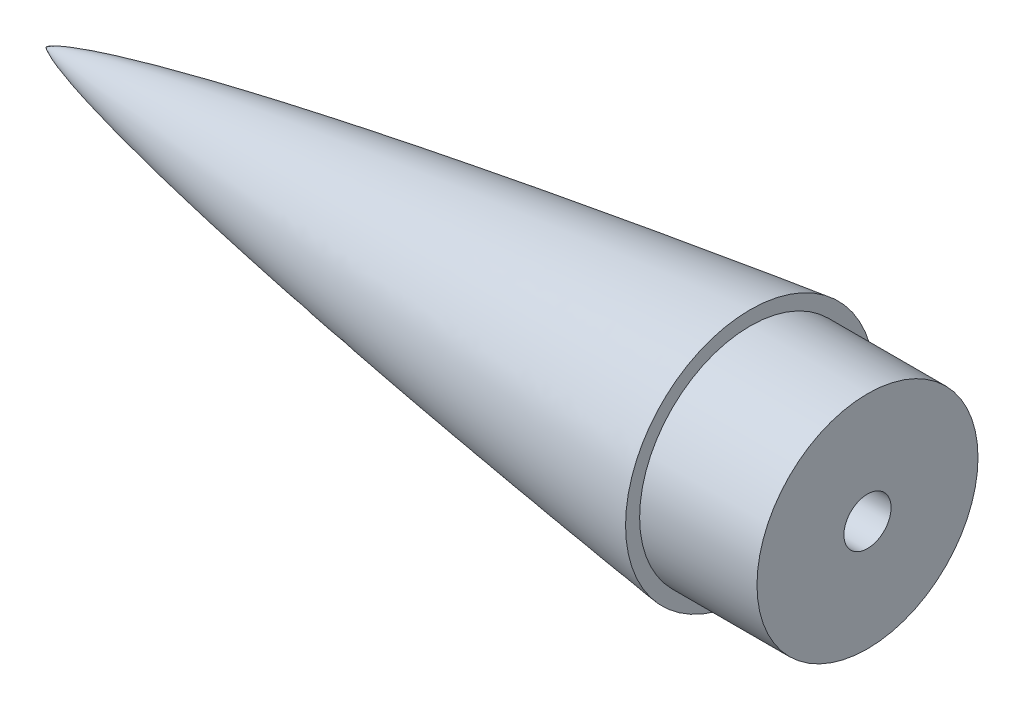
ISO-10303-21;
HEADER;
FILE_DESCRIPTION(('STEP AP214'),'2;1');
FILE_NAME('part.step','',(''),(''),'','','');
FILE_SCHEMA(('AUTOMOTIVE_DESIGN { 1 0 10303 214 1 1 1 1 }'));
ENDSEC;
DATA;
#1=APPLICATION_CONTEXT('core data for automotive mechanical design processes');
#2=APPLICATION_PROTOCOL_DEFINITION('international standard','automotive_design',2000,#1);
#3=PRODUCT_CONTEXT('',#1,'mechanical');
#4=PRODUCT('Part','Part','',(#3));
#5=PRODUCT_RELATED_PRODUCT_CATEGORY('part','',(#4));
#6=PRODUCT_DEFINITION_FORMATION('','',#4);
#7=PRODUCT_DEFINITION_CONTEXT('part definition',#1,'design');
#8=PRODUCT_DEFINITION('design','',#6,#7);
#9=PRODUCT_DEFINITION_SHAPE('','',#8);
#10=(LENGTH_UNIT() NAMED_UNIT(*) SI_UNIT(.MILLI.,.METRE.));
#11=(NAMED_UNIT(*) PLANE_ANGLE_UNIT() SI_UNIT($,.RADIAN.));
#12=(NAMED_UNIT(*) SI_UNIT($,.STERADIAN.) SOLID_ANGLE_UNIT());
#13=UNCERTAINTY_MEASURE_WITH_UNIT(LENGTH_MEASURE(1.E-05),#10,'distance_accuracy_value','');
#14=(GEOMETRIC_REPRESENTATION_CONTEXT(3) GLOBAL_UNCERTAINTY_ASSIGNED_CONTEXT((#13)) GLOBAL_UNIT_ASSIGNED_CONTEXT((#10,
#11,#12)) REPRESENTATION_CONTEXT('',''));
#15=CARTESIAN_POINT('',(0.,0.,0.));
#16=DIRECTION('',(0.,0.,1.));
#17=DIRECTION('',(1.,0.,0.));
#18=AXIS2_PLACEMENT_3D('',#15,#16,#17);
#19=CARTESIAN_POINT('',(0.,0.,0.));
#20=CARTESIAN_POINT('',(0.00257181598876534,0.00563647892327808,0.));
#21=CARTESIAN_POINT('',(0.00865027721043773,0.016277868188067,0.));
#22=CARTESIAN_POINT('',(0.0248384801324466,0.0348685420562156,0.));
#23=CARTESIAN_POINT('',(0.0614384417672664,0.0677963456999341,0.));
#24=CARTESIAN_POINT('',(0.11568341966958,0.108106243141846,0.));
#25=CARTESIAN_POINT('',(0.188045787553973,0.154613181207027,0.));
#26=CARTESIAN_POINT('',(0.290833283887297,0.214020735768307,0.));
#27=CARTESIAN_POINT('',(0.414160492695409,0.278607766397476,0.));
#28=CARTESIAN_POINT('',(0.55877725402866,0.348299143733321,0.));
#29=CARTESIAN_POINT('',(0.724730868066843,0.422703949125703,0.));
#30=CARTESIAN_POINT('',(0.964147344984012,0.524034823726031,0.));
#31=CARTESIAN_POINT('',(1.33465355418264,0.669679439824667,0.));
#32=CARTESIAN_POINT('',(1.96929361417393,0.897871424823104,0.));
#33=CARTESIAN_POINT('',(3.10701235418423,1.26505033553077,0.));
#34=CARTESIAN_POINT('',(5.14211506959707,1.84723026384309,0.));
#35=CARTESIAN_POINT('',(8.92455603778403,2.79359231386745,0.));
#36=CARTESIAN_POINT('',(16.0542729377819,4.33351779649455,0.));
#37=CARTESIAN_POINT('',(28.7745076201062,6.68193864572946,0.));
#38=CARTESIAN_POINT('',(49.7554347112055,9.993969511993,0.));
#39=CARTESIAN_POINT('',(78.1202345562474,13.844366236506,0.));
#40=CARTESIAN_POINT('',(112.134667742365,17.9128091000318,0.));
#41=CARTESIAN_POINT('',(149.319983257708,21.9007652238848,0.));
#42=CARTESIAN_POINT('',(186.540620523021,25.5413654843358,0.));
#43=CARTESIAN_POINT('',(223.788346525204,28.8925827212558,0.));
#44=CARTESIAN_POINT('',(261.057875937366,31.9908904002058,0.));
#45=CARTESIAN_POINT('',(298.345861541793,34.8582676495802,0.));
#46=CARTESIAN_POINT('',(335.649901649591,37.5082181088045,0.));
#47=CARTESIAN_POINT('',(372.968338263528,39.9470386835439,0.));
#48=CARTESIAN_POINT('',(410.299941717992,42.17527884003,0.));
#49=CARTESIAN_POINT('',(447.643848849022,44.1871595027002,0.));
#50=CARTESIAN_POINT('',(484.999447818464,45.9695757743082,0.));
#51=CARTESIAN_POINT('',(517.695494353918,47.3071895888364,0.));
#52=CARTESIAN_POINT('',(545.727627469833,48.2681790997089,0.));
#53=CARTESIAN_POINT('',(568.326311807242,48.8964051457863,0.));
#54=CARTESIAN_POINT('',(583.534683101899,49.2340511122822,0.));
#55=CARTESIAN_POINT('',(596.024563936293,49.4397361119118,0.));
#56=CARTESIAN_POINT('',(603.84094835907,49.5198604542286,0.));
#57=CARTESIAN_POINT('',(607.749290512623,49.5425065020114,0.));
#58=CARTESIAN_POINT('',(609.70348535128,49.5425065020114,0.));
#59=B_SPLINE_CURVE_WITH_KNOTS('',4,(#19,#20,#21,#22,#23,#24,#25,#26,#27,#28,#29,#30,#31,#32,#33,
#34,#35,#36,#37,#38,#39,#40,#41,#42,#43,#44,#45,#46,#47,#48,#49,#50,#51,#52,#53,#54,#55,#56,#57,
#58),.UNSPECIFIED.,.F.,.F.,(5,1,1,1,1,1,1,1,1,1,1,1,1,1,1,1,1,1,1,1,1,1,1,1,1,1,1,1,1,1,1,1,1,1,
1,1,5),(0.,4.00959970283614E-05,8.01919940567228E-05,0.000160383988113446,0.000320767976226891,
0.000481151964340337,0.000641535952453783,0.000935614848436856,0.00122969374441993,
0.00152943900771313,0.00182918427100634,0.00263340723966375,0.00382932312564767,
0.00593329825828828,0.0096355048169594,0.0164551902691907,0.0292891879306469,0.0535632002983768,
0.0941033087021242,0.155163744590855,0.216224183272472,0.277284623116365,0.338345063432345,
0.399405503930121,0.460465944472848,0.521526384986833,0.58258682542494,0.643647265749543,
0.704707705922787,0.765768146139735,0.826828586986675,0.887889027586075,0.918419247730054,
0.948949467874033,0.974474733937016,0.987237366968508,1.),.UNSPECIFIED.);
#60=CARTESIAN_POINT('',(0.,0.,0.));
#61=DIRECTION('',(-1.,0.,0.));
#62=AXIS1_PLACEMENT('',#60,#61);
#63=SURFACE_OF_REVOLUTION('',#59,#62);
#64=CARTESIAN_POINT('',(76.2,0.,0.));
#65=DIRECTION('',(-1.,0.,0.));
#66=DIRECTION('',(0.,0.,1.));
#67=AXIS2_PLACEMENT_3D('',#64,#65,#66);
#68=CIRCLE('',#67,13.4842536327206);
#69=CARTESIAN_POINT('',(76.2,0.,13.4842536327206));
#70=VERTEX_POINT('',#69);
#71=EDGE_CURVE('E51',#70,#70,#68,.T.);
#72=ORIENTED_EDGE('',*,*,#71,.T.);
#73=EDGE_LOOP('',(#72));
#74=FACE_BOUND('',#73,.T.);
#75=CARTESIAN_POINT('',(0.,0.,0.));
#76=VERTEX_POINT('',#75);
#77=VERTEX_LOOP('',#76);
#78=FACE_BOUND('',#77,.T.);
#79=ADVANCED_FACE('F47',(#74,#78),#63,.F.);
#80=CARTESIAN_POINT('',(76.2,0.,0.));
#81=DIRECTION('',(1.,0.,0.));
#82=DIRECTION('',(0.,0.,-1.));
#83=AXIS2_PLACEMENT_3D('',#80,#81,#82);
#84=PLANE('',#83);
#85=CARTESIAN_POINT('',(76.2,0.,0.));
#86=DIRECTION('',(1.,0.,0.));
#87=DIRECTION('',(0.,0.,-1.));
#88=AXIS2_PLACEMENT_3D('',#85,#86,#87);
#89=CIRCLE('',#88,11.9602536327206);
#90=CARTESIAN_POINT('',(76.2,0.,-11.9602536327206));
#91=VERTEX_POINT('',#90);
#92=EDGE_CURVE('E11',#91,#91,#89,.T.);
#93=ORIENTED_EDGE('',*,*,#92,.F.);
#94=EDGE_LOOP('',(#93));
#95=FACE_BOUND('',#94,.T.);
#96=ORIENTED_EDGE('',*,*,#71,.F.);
#97=EDGE_LOOP('',(#96));
#98=FACE_BOUND('',#97,.T.);
#99=ADVANCED_FACE('F99',(#95,#98),#84,.T.);
#100=CARTESIAN_POINT('',(88.9,0.,0.));
#101=DIRECTION('',(-1.,0.,0.));
#102=DIRECTION('',(0.,0.,1.));
#103=AXIS2_PLACEMENT_3D('',#100,#101,#102);
#104=CYLINDRICAL_SURFACE('',#103,11.9602536327206);
#105=CARTESIAN_POINT('',(88.9,0.,0.));
#106=DIRECTION('',(1.,0.,0.));
#107=DIRECTION('',(0.,0.,-1.));
#108=AXIS2_PLACEMENT_3D('',#105,#106,#107);
#109=CIRCLE('',#108,11.9602536327206);
#110=CARTESIAN_POINT('',(88.9,0.,-11.9602536327206));
#111=VERTEX_POINT('',#110);
#112=EDGE_CURVE('E73',#111,#111,#109,.T.);
#113=ORIENTED_EDGE('',*,*,#112,.F.);
#114=EDGE_LOOP('',(#113));
#115=FACE_BOUND('',#114,.T.);
#116=ORIENTED_EDGE('',*,*,#92,.T.);
#117=EDGE_LOOP('',(#116));
#118=FACE_BOUND('',#117,.T.);
#119=ADVANCED_FACE('F93',(#115,#118),#104,.T.);
#120=CARTESIAN_POINT('',(88.9,0.,0.));
#121=DIRECTION('',(1.,0.,0.));
#122=DIRECTION('',(0.,0.,-1.));
#123=AXIS2_PLACEMENT_3D('',#120,#121,#122);
#124=PLANE('',#123);
#125=CARTESIAN_POINT('',(88.9,0.,0.));
#126=DIRECTION('',(1.,0.,0.));
#127=DIRECTION('',(0.,0.,-1.));
#128=AXIS2_PLACEMENT_3D('',#125,#126,#127);
#129=CIRCLE('',#128,2.55269999999999);
#130=CARTESIAN_POINT('',(88.9,0.,-2.55269999999999));
#131=VERTEX_POINT('',#130);
#132=EDGE_CURVE('E74',#131,#131,#129,.T.);
#133=ORIENTED_EDGE('',*,*,#132,.F.);
#134=EDGE_LOOP('',(#133));
#135=FACE_BOUND('',#134,.T.);
#136=ORIENTED_EDGE('',*,*,#112,.T.);
#137=EDGE_LOOP('',(#136));
#138=FACE_BOUND('',#137,.T.);
#139=ADVANCED_FACE('F66',(#135,#138),#124,.T.);
#140=CARTESIAN_POINT('',(39.6338169021917,0.,0.));
#141=DIRECTION('',(1.,0.,0.));
#142=DIRECTION('',(0.,0.,-1.));
#143=AXIS2_PLACEMENT_3D('',#140,#141,#142);
#144=CONICAL_SURFACE('',#143,2.55269999999999,1.02974425867665);
#145=CARTESIAN_POINT('',(38.1,0.,0.));
#146=VERTEX_POINT('',#145);
#147=VERTEX_LOOP('',#146);
#148=FACE_BOUND('',#147,.T.);
#149=CARTESIAN_POINT('',(39.6338169021917,0.,0.));
#150=DIRECTION('',(1.,0.,0.));
#151=DIRECTION('',(0.,0.,-1.));
#152=AXIS2_PLACEMENT_3D('',#149,#150,#151);
#153=CIRCLE('',#152,2.55269999999999);
#154=CARTESIAN_POINT('',(39.6338169021917,0.,-2.55269999999999));
#155=VERTEX_POINT('',#154);
#156=EDGE_CURVE('E70',#155,#155,#153,.T.);
#157=ORIENTED_EDGE('',*,*,#156,.T.);
#158=EDGE_LOOP('',(#157));
#159=FACE_BOUND('',#158,.T.);
#160=ADVANCED_FACE('F62',(#148,#159),#144,.F.);
#161=CARTESIAN_POINT('',(88.9,0.,0.));
#162=DIRECTION('',(1.,0.,0.));
#163=DIRECTION('',(0.,0.,-1.));
#164=AXIS2_PLACEMENT_3D('',#161,#162,#163);
#165=CYLINDRICAL_SURFACE('',#164,2.55269999999999);
#166=ORIENTED_EDGE('',*,*,#156,.F.);
#167=EDGE_LOOP('',(#166));
#168=FACE_BOUND('',#167,.T.);
#169=ORIENTED_EDGE('',*,*,#132,.T.);
#170=EDGE_LOOP('',(#169));
#171=FACE_BOUND('',#170,.T.);
#172=ADVANCED_FACE('F65',(#168,#171),#165,.F.);
#173=CLOSED_SHELL('',(#79,#99,#119,#139,#160,#172));
#174=MANIFOLD_SOLID_BREP('B2',#173);
#175=ADVANCED_BREP_SHAPE_REPRESENTATION('',(#18,#174),#14);
#176=SHAPE_DEFINITION_REPRESENTATION(#9,#175);
ENDSEC;
END-ISO-10303-21;
